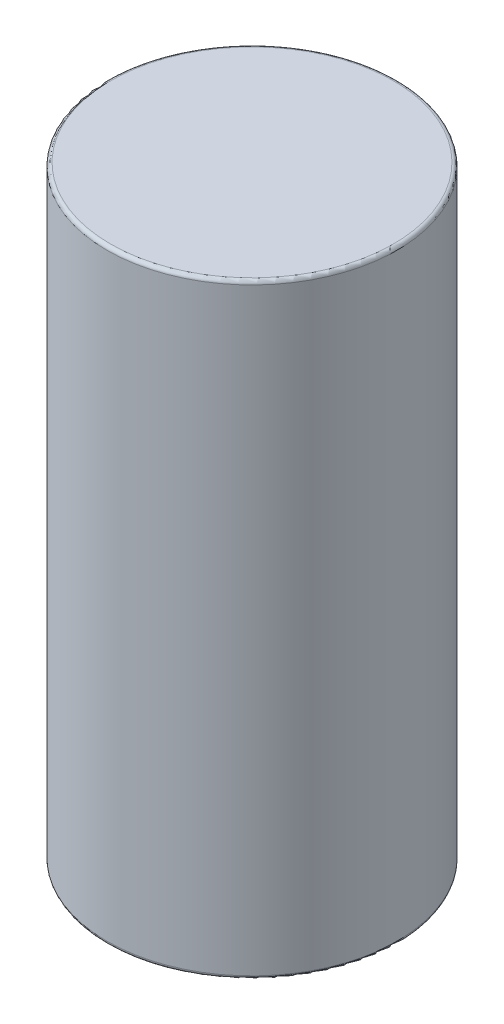
ISO-10303-21;
HEADER;
FILE_DESCRIPTION(('STEP AP214'),'2;1');
FILE_NAME('part.step','',(''),(''),'','','');
FILE_SCHEMA(('AUTOMOTIVE_DESIGN { 1 0 10303 214 1 1 1 1 }'));
ENDSEC;
DATA;
#1=APPLICATION_CONTEXT('core data for automotive mechanical design processes');
#2=APPLICATION_PROTOCOL_DEFINITION('international standard','automotive_design',2000,#1);
#3=PRODUCT_CONTEXT('',#1,'mechanical');
#4=PRODUCT('Part','Part','',(#3));
#5=PRODUCT_RELATED_PRODUCT_CATEGORY('part','',(#4));
#6=PRODUCT_DEFINITION_FORMATION('','',#4);
#7=PRODUCT_DEFINITION_CONTEXT('part definition',#1,'design');
#8=PRODUCT_DEFINITION('design','',#6,#7);
#9=PRODUCT_DEFINITION_SHAPE('','',#8);
#10=(LENGTH_UNIT() NAMED_UNIT(*) SI_UNIT(.MILLI.,.METRE.));
#11=(NAMED_UNIT(*) PLANE_ANGLE_UNIT() SI_UNIT($,.RADIAN.));
#12=(NAMED_UNIT(*) SI_UNIT($,.STERADIAN.) SOLID_ANGLE_UNIT());
#13=UNCERTAINTY_MEASURE_WITH_UNIT(LENGTH_MEASURE(1.E-05),#10,'distance_accuracy_value','');
#14=(GEOMETRIC_REPRESENTATION_CONTEXT(3) GLOBAL_UNCERTAINTY_ASSIGNED_CONTEXT((#13)) GLOBAL_UNIT_ASSIGNED_CONTEXT((#10,
#11,#12)) REPRESENTATION_CONTEXT('',''));
#15=CARTESIAN_POINT('',(0.,0.,0.));
#16=DIRECTION('',(0.,0.,1.));
#17=DIRECTION('',(1.,0.,0.));
#18=AXIS2_PLACEMENT_3D('',#15,#16,#17);
#19=CARTESIAN_POINT('',(0.,16.7,0.));
#20=DIRECTION('',(0.,-1.,0.));
#21=DIRECTION('',(0.,0.,-1.));
#22=AXIS2_PLACEMENT_3D('',#19,#20,#21);
#23=CYLINDRICAL_SURFACE('',#22,4.);
#24=CARTESIAN_POINT('',(0.,0.0999999999999994,0.));
#25=DIRECTION('',(0.,1.,0.));
#26=DIRECTION('',(0.,0.,1.));
#27=AXIS2_PLACEMENT_3D('',#24,#25,#26);
#28=CIRCLE('',#27,4.);
#29=CARTESIAN_POINT('',(0.,0.0999999999999994,4.));
#30=VERTEX_POINT('',#29);
#31=EDGE_CURVE('E40',#30,#30,#28,.T.);
#32=ORIENTED_EDGE('',*,*,#31,.T.);
#33=EDGE_LOOP('',(#32));
#34=FACE_BOUND('',#33,.T.);
#35=CARTESIAN_POINT('',(0.,16.6,0.));
#36=DIRECTION('',(0.,1.,0.));
#37=DIRECTION('',(0.,0.,1.));
#38=AXIS2_PLACEMENT_3D('',#35,#36,#37);
#39=CIRCLE('',#38,4.);
#40=CARTESIAN_POINT('',(0.,16.6,4.));
#41=VERTEX_POINT('',#40);
#42=EDGE_CURVE('E44',#41,#41,#39,.F.);
#43=ORIENTED_EDGE('',*,*,#42,.T.);
#44=EDGE_LOOP('',(#43));
#45=FACE_BOUND('',#44,.T.);
#46=ADVANCED_FACE('F33',(#34,#45),#23,.T.);
#47=CARTESIAN_POINT('',(0.,16.7,0.));
#48=DIRECTION('',(0.,1.,0.));
#49=DIRECTION('',(0.,0.,1.));
#50=AXIS2_PLACEMENT_3D('',#47,#48,#49);
#51=PLANE('',#50);
#52=CARTESIAN_POINT('',(0.,16.7,0.));
#53=DIRECTION('',(0.,1.,0.));
#54=DIRECTION('',(0.,0.,1.));
#55=AXIS2_PLACEMENT_3D('',#52,#53,#54);
#56=CIRCLE('',#55,3.9);
#57=CARTESIAN_POINT('',(0.,16.7,3.9));
#58=VERTEX_POINT('',#57);
#59=EDGE_CURVE('E48',#58,#58,#56,.T.);
#60=ORIENTED_EDGE('',*,*,#59,.T.);
#61=EDGE_LOOP('',(#60));
#62=FACE_BOUND('',#61,.T.);
#63=ADVANCED_FACE('F54',(#62),#51,.T.);
#64=CARTESIAN_POINT('',(0.,0.,0.));
#65=DIRECTION('',(0.,1.,0.));
#66=DIRECTION('',(0.,0.,1.));
#67=AXIS2_PLACEMENT_3D('',#64,#65,#66);
#68=PLANE('',#67);
#69=CARTESIAN_POINT('',(0.,0.,0.));
#70=DIRECTION('',(0.,1.,0.));
#71=DIRECTION('',(0.,0.,1.));
#72=AXIS2_PLACEMENT_3D('',#69,#70,#71);
#73=CIRCLE('',#72,3.9);
#74=CARTESIAN_POINT('',(0.,0.,3.9));
#75=VERTEX_POINT('',#74);
#76=EDGE_CURVE('E10',#75,#75,#73,.F.);
#77=ORIENTED_EDGE('',*,*,#76,.T.);
#78=EDGE_LOOP('',(#77));
#79=FACE_BOUND('',#78,.T.);
#80=ADVANCED_FACE('F58',(#79),#68,.F.);
#81=CARTESIAN_POINT('',(0.,16.6,0.));
#82=DIRECTION('',(0.,1.,0.));
#83=DIRECTION('',(0.,0.,1.));
#84=AXIS2_PLACEMENT_3D('',#81,#82,#83);
#85=TOROIDAL_SURFACE('',#84,3.9,0.1);
#86=ORIENTED_EDGE('',*,*,#42,.F.);
#87=EDGE_LOOP('',(#86));
#88=FACE_BOUND('',#87,.T.);
#89=ORIENTED_EDGE('',*,*,#59,.F.);
#90=EDGE_LOOP('',(#89));
#91=FACE_BOUND('',#90,.T.);
#92=ADVANCED_FACE('F56',(#88,#91),#85,.T.);
#93=CARTESIAN_POINT('',(0.,0.0999999999999994,0.));
#94=DIRECTION('',(0.,1.,0.));
#95=DIRECTION('',(0.,0.,1.));
#96=AXIS2_PLACEMENT_3D('',#93,#94,#95);
#97=TOROIDAL_SURFACE('',#96,3.9,0.1);
#98=ORIENTED_EDGE('',*,*,#76,.F.);
#99=EDGE_LOOP('',(#98));
#100=FACE_BOUND('',#99,.T.);
#101=ORIENTED_EDGE('',*,*,#31,.F.);
#102=EDGE_LOOP('',(#101));
#103=FACE_BOUND('',#102,.T.);
#104=ADVANCED_FACE('F35',(#100,#103),#97,.T.);
#105=CLOSED_SHELL('',(#46,#63,#80,#92,#104));
#106=MANIFOLD_SOLID_BREP('B2',#105);
#107=ADVANCED_BREP_SHAPE_REPRESENTATION('',(#18,#106),#14);
#108=SHAPE_DEFINITION_REPRESENTATION(#9,#107);
ENDSEC;
END-ISO-10303-21;
